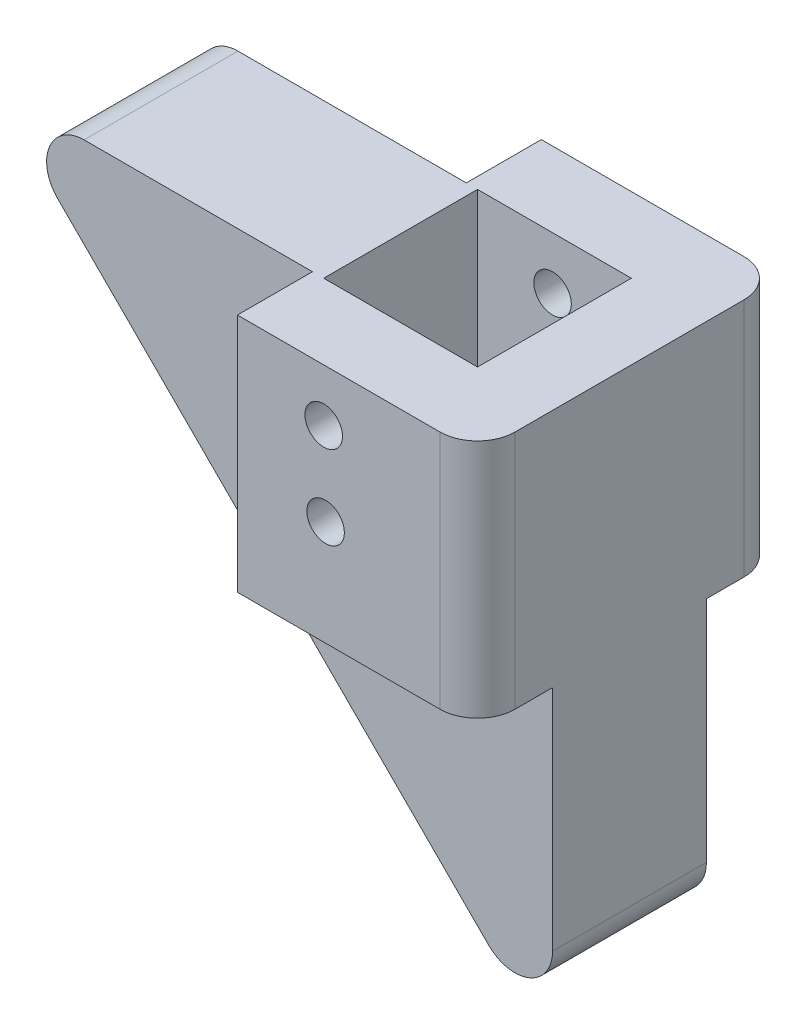
ISO-10303-21;
HEADER;
FILE_DESCRIPTION(('STEP AP214'),'2;1');
FILE_NAME('part.step','',(''),(''),'','','');
FILE_SCHEMA(('AUTOMOTIVE_DESIGN { 1 0 10303 214 1 1 1 1 }'));
ENDSEC;
DATA;
#1=APPLICATION_CONTEXT('core data for automotive mechanical design processes');
#2=APPLICATION_PROTOCOL_DEFINITION('international standard','automotive_design',2000,#1);
#3=PRODUCT_CONTEXT('',#1,'mechanical');
#4=PRODUCT('Part','Part','',(#3));
#5=PRODUCT_RELATED_PRODUCT_CATEGORY('part','',(#4));
#6=PRODUCT_DEFINITION_FORMATION('','',#4);
#7=PRODUCT_DEFINITION_CONTEXT('part definition',#1,'design');
#8=PRODUCT_DEFINITION('design','',#6,#7);
#9=PRODUCT_DEFINITION_SHAPE('','',#8);
#10=(LENGTH_UNIT() NAMED_UNIT(*) SI_UNIT(.MILLI.,.METRE.));
#11=(NAMED_UNIT(*) PLANE_ANGLE_UNIT() SI_UNIT($,.RADIAN.));
#12=(NAMED_UNIT(*) SI_UNIT($,.STERADIAN.) SOLID_ANGLE_UNIT());
#13=UNCERTAINTY_MEASURE_WITH_UNIT(LENGTH_MEASURE(1.E-05),#10,'distance_accuracy_value','');
#14=(GEOMETRIC_REPRESENTATION_CONTEXT(3) GLOBAL_UNCERTAINTY_ASSIGNED_CONTEXT((#13)) GLOBAL_UNIT_ASSIGNED_CONTEXT((#10,
#11,#12)) REPRESENTATION_CONTEXT('',''));
#15=CARTESIAN_POINT('',(0.,0.,0.));
#16=DIRECTION('',(0.,0.,1.));
#17=DIRECTION('',(1.,0.,0.));
#18=AXIS2_PLACEMENT_3D('',#15,#16,#17);
#19=CARTESIAN_POINT('',(0.,0.,0.));
#20=DIRECTION('',(0.,0.,1.));
#21=DIRECTION('',(1.,0.,0.));
#22=AXIS2_PLACEMENT_3D('',#19,#20,#21);
#23=PLANE('',#22);
#24=CARTESIAN_POINT('',(2.37412982933467,-20.8727925216274,0.));
#25=DIRECTION('',(0.,0.,1.));
#26=DIRECTION('',(1.,0.,0.));
#27=AXIS2_PLACEMENT_3D('',#24,#25,#26);
#28=CIRCLE('',#27,2.5);
#29=CARTESIAN_POINT('',(4.87412982933467,-20.8727925216274,0.));
#30=VERTEX_POINT('',#29);
#31=EDGE_CURVE('E222',#30,#30,#28,.T.);
#32=ORIENTED_EDGE('',*,*,#31,.T.);
#33=EDGE_LOOP('',(#32));
#34=FACE_BOUND('',#33,.T.);
#35=CARTESIAN_POINT('',(-12.298157313412,-6.20050537888066,0.));
#36=DIRECTION('',(0.,0.,1.));
#37=DIRECTION('',(1.,0.,0.));
#38=AXIS2_PLACEMENT_3D('',#35,#36,#37);
#39=CIRCLE('',#38,2.5);
#40=CARTESIAN_POINT('',(-9.79815731341203,-6.20050537888066,0.));
#41=VERTEX_POINT('',#40);
#42=EDGE_CURVE('E230',#41,#41,#39,.T.);
#43=ORIENTED_EDGE('',*,*,#42,.T.);
#44=EDGE_LOOP('',(#43));
#45=FACE_BOUND('',#44,.T.);
#46=DIRECTION('',(0.,-1.,0.));
#47=VECTOR('',#46,1.);
#48=CARTESIAN_POINT('',(26.701842686588,0.,0.));
#49=LINE('',#48,#47);
#50=CARTESIAN_POINT('',(26.701842686588,-13.8727925216274,0.));
#51=VERTEX_POINT('',#50);
#52=CARTESIAN_POINT('',(26.701842686588,-44.3017247097626,0.));
#53=VERTEX_POINT('',#52);
#54=EDGE_CURVE('E292',#51,#53,#49,.T.);
#55=ORIENTED_EDGE('',*,*,#54,.T.);
#56=CARTESIAN_POINT('',(21.701842686588,-44.3017247097626,0.));
#57=DIRECTION('',(0.,0.,1.));
#58=DIRECTION('',(1.,0.,0.));
#59=AXIS2_PLACEMENT_3D('',#56,#57,#58);
#60=CIRCLE('',#59,5.);
#61=CARTESIAN_POINT('',(18.1663087806552,-47.8372586156953,0.));
#62=VERTEX_POINT('',#61);
#63=EDGE_CURVE('E378',#53,#62,#60,.F.);
#64=ORIENTED_EDGE('',*,*,#63,.T.);
#65=DIRECTION('',(-0.707106781186544,0.707106781186551,0.));
#66=VECTOR('',#65,1.);
#67=CARTESIAN_POINT('',(-14.8354749175199,-14.8354749175198,0.));
#68=LINE('',#67,#66);
#69=CARTESIAN_POINT('',(-39.2626234074794,9.59167357243993,0.));
#70=VERTEX_POINT('',#69);
#71=EDGE_CURVE('E325',#62,#70,#68,.T.);
#72=ORIENTED_EDGE('',*,*,#71,.T.);
#73=CARTESIAN_POINT('',(-35.7270895015466,13.1272074783726,0.));
#74=DIRECTION('',(0.,0.,1.));
#75=DIRECTION('',(1.,0.,0.));
#76=AXIS2_PLACEMENT_3D('',#73,#74,#75);
#77=CIRCLE('',#76,5.);
#78=CARTESIAN_POINT('',(-35.7270895015466,18.1272074783727,0.));
#79=VERTEX_POINT('',#78);
#80=EDGE_CURVE('E375',#70,#79,#77,.F.);
#81=ORIENTED_EDGE('',*,*,#80,.T.);
#82=DIRECTION('',(1.,0.,0.));
#83=VECTOR('',#82,1.);
#84=CARTESIAN_POINT('',(0.,18.1272074783727,0.));
#85=LINE('',#84,#83);
#86=CARTESIAN_POINT('',(-5.29815731341203,18.1272074783727,0.));
#87=VERTEX_POINT('',#86);
#88=EDGE_CURVE('E322',#79,#87,#85,.T.);
#89=ORIENTED_EDGE('',*,*,#88,.T.);
#90=DIRECTION('',(0.,1.,0.));
#91=VECTOR('',#90,1.);
#92=CARTESIAN_POINT('',(-5.29815731341203,-13.8727925216274,0.));
#93=LINE('',#92,#91);
#94=CARTESIAN_POINT('',(-5.29815731341203,-13.8727925216274,0.));
#95=VERTEX_POINT('',#94);
#96=EDGE_CURVE('E275',#95,#87,#93,.T.);
#97=ORIENTED_EDGE('',*,*,#96,.F.);
#98=DIRECTION('',(-1.,0.,0.));
#99=VECTOR('',#98,1.);
#100=CARTESIAN_POINT('',(26.701842686588,-13.8727925216274,0.));
#101=LINE('',#100,#99);
#102=EDGE_CURVE('E183',#51,#95,#101,.T.);
#103=ORIENTED_EDGE('',*,*,#102,.F.);
#104=EDGE_LOOP('',(#55,#64,#72,#81,#89,#97,#103));
#105=FACE_BOUND('',#104,.T.);
#106=ADVANCED_FACE('F43',(#34,#45,#105),#23,.F.);
#107=CARTESIAN_POINT('',(16.701842686588,0.,20.5));
#108=DIRECTION('',(-1.,0.,0.));
#109=DIRECTION('',(0.,0.,1.));
#110=AXIS2_PLACEMENT_3D('',#107,#108,#109);
#111=PLANE('',#110);
#112=DIRECTION('',(0.,1.,0.));
#113=VECTOR('',#112,1.);
#114=CARTESIAN_POINT('',(16.701842686588,0.,0.));
#115=LINE('',#114,#113);
#116=CARTESIAN_POINT('',(16.701842686588,-6.87279252162735,0.));
#117=VERTEX_POINT('',#116);
#118=CARTESIAN_POINT('',(16.701842686588,18.1272074783727,0.));
#119=VERTEX_POINT('',#118);
#120=EDGE_CURVE('E286',#117,#119,#115,.T.);
#121=ORIENTED_EDGE('',*,*,#120,.F.);
#122=DIRECTION('',(0.,0.,-1.));
#123=VECTOR('',#122,1.);
#124=CARTESIAN_POINT('',(16.701842686588,-6.87279252162735,20.5));
#125=LINE('',#124,#123);
#126=CARTESIAN_POINT('',(16.701842686588,-6.87279252162735,20.5));
#127=VERTEX_POINT('',#126);
#128=EDGE_CURVE('E344',#127,#117,#125,.T.);
#129=ORIENTED_EDGE('',*,*,#128,.F.);
#130=DIRECTION('',(0.,1.,0.));
#131=VECTOR('',#130,1.);
#132=CARTESIAN_POINT('',(16.701842686588,0.,20.5));
#133=LINE('',#132,#131);
#134=CARTESIAN_POINT('',(16.701842686588,18.1272074783727,20.5));
#135=VERTEX_POINT('',#134);
#136=EDGE_CURVE('E287',#127,#135,#133,.T.);
#137=ORIENTED_EDGE('',*,*,#136,.T.);
#138=DIRECTION('',(0.,0.,-1.));
#139=VECTOR('',#138,1.);
#140=CARTESIAN_POINT('',(16.701842686588,18.1272074783727,20.5));
#141=LINE('',#140,#139);
#142=EDGE_CURVE('E310',#135,#119,#141,.T.);
#143=ORIENTED_EDGE('',*,*,#142,.T.);
#144=EDGE_LOOP('',(#121,#129,#137,#143));
#145=FACE_BOUND('',#144,.T.);
#146=ADVANCED_FACE('F445',(#145),#111,.T.);
#147=CARTESIAN_POINT('',(0.,-6.87279252162735,20.5));
#148=DIRECTION('',(0.,1.,0.));
#149=DIRECTION('',(0.,0.,1.));
#150=AXIS2_PLACEMENT_3D('',#147,#148,#149);
#151=PLANE('',#150);
#152=DIRECTION('',(1.,0.,0.));
#153=VECTOR('',#152,1.);
#154=CARTESIAN_POINT('',(0.,-6.87279252162735,0.));
#155=LINE('',#154,#153);
#156=CARTESIAN_POINT('',(-3.79815731341203,-6.87279252162735,0.));
#157=VERTEX_POINT('',#156);
#158=EDGE_CURVE('E314',#157,#117,#155,.T.);
#159=ORIENTED_EDGE('',*,*,#158,.F.);
#160=DIRECTION('',(0.,0.,-1.));
#161=VECTOR('',#160,1.);
#162=CARTESIAN_POINT('',(-3.79815731341203,-6.87279252162735,20.5));
#163=LINE('',#162,#161);
#164=CARTESIAN_POINT('',(-3.79815731341203,-6.87279252162735,20.5));
#165=VERTEX_POINT('',#164);
#166=EDGE_CURVE('E341',#165,#157,#163,.T.);
#167=ORIENTED_EDGE('',*,*,#166,.F.);
#168=DIRECTION('',(1.,0.,0.));
#169=VECTOR('',#168,1.);
#170=CARTESIAN_POINT('',(0.,-6.87279252162735,20.5));
#171=LINE('',#170,#169);
#172=EDGE_CURVE('E291',#165,#127,#171,.T.);
#173=ORIENTED_EDGE('',*,*,#172,.T.);
#174=ORIENTED_EDGE('',*,*,#128,.T.);
#175=EDGE_LOOP('',(#159,#167,#173,#174));
#176=FACE_BOUND('',#175,.T.);
#177=ADVANCED_FACE('F451',(#176),#151,.T.);
#178=CARTESIAN_POINT('',(-3.79815731341203,0.,20.5));
#179=DIRECTION('',(1.,0.,0.));
#180=DIRECTION('',(0.,0.,-1.));
#181=AXIS2_PLACEMENT_3D('',#178,#179,#180);
#182=PLANE('',#181);
#183=DIRECTION('',(0.,-1.,0.));
#184=VECTOR('',#183,1.);
#185=CARTESIAN_POINT('',(-3.79815731341203,0.,0.));
#186=LINE('',#185,#184);
#187=CARTESIAN_POINT('',(-3.79815731341203,18.1272074783727,0.));
#188=VERTEX_POINT('',#187);
#189=EDGE_CURVE('E318',#188,#157,#186,.T.);
#190=ORIENTED_EDGE('',*,*,#189,.F.);
#191=DIRECTION('',(0.,0.,-1.));
#192=VECTOR('',#191,1.);
#193=CARTESIAN_POINT('',(-3.79815731341203,18.1272074783727,20.5));
#194=LINE('',#193,#192);
#195=CARTESIAN_POINT('',(-3.79815731341203,18.1272074783727,20.5));
#196=VERTEX_POINT('',#195);
#197=EDGE_CURVE('E338',#196,#188,#194,.T.);
#198=ORIENTED_EDGE('',*,*,#197,.F.);
#199=DIRECTION('',(0.,-1.,0.));
#200=VECTOR('',#199,1.);
#201=CARTESIAN_POINT('',(-3.79815731341203,0.,20.5));
#202=LINE('',#201,#200);
#203=EDGE_CURVE('E296',#196,#165,#202,.T.);
#204=ORIENTED_EDGE('',*,*,#203,.T.);
#205=ORIENTED_EDGE('',*,*,#166,.T.);
#206=EDGE_LOOP('',(#190,#198,#204,#205));
#207=FACE_BOUND('',#206,.T.);
#208=ADVANCED_FACE('F465',(#207),#182,.T.);
#209=CARTESIAN_POINT('',(-14.8354749175199,-14.8354749175198,20.5));
#210=DIRECTION('',(-0.707106781186551,-0.707106781186544,0.));
#211=DIRECTION('',(0.707106781186544,-0.707106781186551,0.));
#212=AXIS2_PLACEMENT_3D('',#209,#210,#211);
#213=PLANE('',#212);
#214=ORIENTED_EDGE('',*,*,#71,.F.);
#215=DIRECTION('',(0.,0.,-1.));
#216=VECTOR('',#215,1.);
#217=CARTESIAN_POINT('',(18.1663087806552,-47.8372586156953,20.5));
#218=LINE('',#217,#216);
#219=CARTESIAN_POINT('',(18.1663087806552,-47.8372586156953,20.5));
#220=VERTEX_POINT('',#219);
#221=EDGE_CURVE('E385',#62,#220,#218,.F.);
#222=ORIENTED_EDGE('',*,*,#221,.T.);
#223=DIRECTION('',(-0.707106781186544,0.707106781186551,0.));
#224=VECTOR('',#223,1.);
#225=CARTESIAN_POINT('',(-14.8354749175199,-14.8354749175198,20.5));
#226=LINE('',#225,#224);
#227=CARTESIAN_POINT('',(-39.2626234074794,9.59167357243993,20.5));
#228=VERTEX_POINT('',#227);
#229=EDGE_CURVE('E303',#220,#228,#226,.T.);
#230=ORIENTED_EDGE('',*,*,#229,.T.);
#231=DIRECTION('',(0.,0.,-1.));
#232=VECTOR('',#231,1.);
#233=CARTESIAN_POINT('',(-39.2626234074794,9.59167357243993,20.5));
#234=LINE('',#233,#232);
#235=EDGE_CURVE('E381',#228,#70,#234,.T.);
#236=ORIENTED_EDGE('',*,*,#235,.T.);
#237=EDGE_LOOP('',(#214,#222,#230,#236));
#238=FACE_BOUND('',#237,.T.);
#239=ADVANCED_FACE('F404',(#238),#213,.T.);
#240=CARTESIAN_POINT('',(26.701842686588,0.,20.5));
#241=DIRECTION('',(1.,0.,0.));
#242=DIRECTION('',(0.,1.,0.));
#243=AXIS2_PLACEMENT_3D('',#240,#241,#242);
#244=PLANE('',#243);
#245=DIRECTION('',(0.,-1.,0.));
#246=VECTOR('',#245,1.);
#247=CARTESIAN_POINT('',(26.701842686588,0.,20.5));
#248=LINE('',#247,#246);
#249=CARTESIAN_POINT('',(26.701842686588,-13.8727925216274,20.5));
#250=VERTEX_POINT('',#249);
#251=CARTESIAN_POINT('',(26.701842686588,-44.3017247097626,20.5));
#252=VERTEX_POINT('',#251);
#253=EDGE_CURVE('E306',#250,#252,#248,.T.);
#254=ORIENTED_EDGE('',*,*,#253,.T.);
#255=DIRECTION('',(0.,0.,-1.));
#256=VECTOR('',#255,1.);
#257=CARTESIAN_POINT('',(26.701842686588,-44.3017247097626,20.5));
#258=LINE('',#257,#256);
#259=EDGE_CURVE('E371',#252,#53,#258,.T.);
#260=ORIENTED_EDGE('',*,*,#259,.T.);
#261=ORIENTED_EDGE('',*,*,#54,.F.);
#262=DIRECTION('',(0.,0.,1.));
#263=VECTOR('',#262,1.);
#264=CARTESIAN_POINT('',(26.701842686588,-13.8727925216274,-8.));
#265=LINE('',#264,#263);
#266=CARTESIAN_POINT('',(26.701842686588,-13.8727925216274,-5.));
#267=VERTEX_POINT('',#266);
#268=EDGE_CURVE('E187',#267,#51,#265,.T.);
#269=ORIENTED_EDGE('',*,*,#268,.F.);
#270=DIRECTION('',(0.,-1.,0.));
#271=VECTOR('',#270,1.);
#272=CARTESIAN_POINT('',(26.701842686588,18.1272074783727,-5.));
#273=LINE('',#272,#271);
#274=CARTESIAN_POINT('',(26.701842686588,18.1272074783727,-5.));
#275=VERTEX_POINT('',#274);
#276=EDGE_CURVE('E355',#267,#275,#273,.F.);
#277=ORIENTED_EDGE('',*,*,#276,.T.);
#278=DIRECTION('',(0.,0.,-1.));
#279=VECTOR('',#278,1.);
#280=CARTESIAN_POINT('',(26.701842686588,18.1272074783727,20.5));
#281=LINE('',#280,#279);
#282=CARTESIAN_POINT('',(26.701842686588,18.1272074783727,25.5));
#283=VERTEX_POINT('',#282);
#284=EDGE_CURVE('E334',#283,#275,#281,.T.);
#285=ORIENTED_EDGE('',*,*,#284,.F.);
#286=DIRECTION('',(0.,1.,0.));
#287=VECTOR('',#286,1.);
#288=CARTESIAN_POINT('',(26.701842686588,-13.8727925216274,25.5));
#289=LINE('',#288,#287);
#290=CARTESIAN_POINT('',(26.701842686588,-13.8727925216274,25.5));
#291=VERTEX_POINT('',#290);
#292=EDGE_CURVE('E352',#283,#291,#289,.F.);
#293=ORIENTED_EDGE('',*,*,#292,.T.);
#294=DIRECTION('',(0.,0.,-1.));
#295=VECTOR('',#294,1.);
#296=CARTESIAN_POINT('',(26.701842686588,-13.8727925216274,27.5));
#297=LINE('',#296,#295);
#298=EDGE_CURVE('E262',#291,#250,#297,.T.);
#299=ORIENTED_EDGE('',*,*,#298,.T.);
#300=EDGE_LOOP('',(#254,#260,#261,#269,#277,#285,#293,#299));
#301=FACE_BOUND('',#300,.T.);
#302=ADVANCED_FACE('F397',(#301),#244,.T.);
#303=CARTESIAN_POINT('',(0.,18.1272074783727,20.5));
#304=DIRECTION('',(0.,1.,0.));
#305=DIRECTION('',(0.,0.,1.));
#306=AXIS2_PLACEMENT_3D('',#303,#304,#305);
#307=PLANE('',#306);
#308=DIRECTION('',(-1.,0.,0.));
#309=VECTOR('',#308,1.);
#310=CARTESIAN_POINT('',(26.701842686588,18.1272074783727,20.5));
#311=LINE('',#310,#309);
#312=EDGE_CURVE('E250',#135,#196,#311,.T.);
#313=ORIENTED_EDGE('',*,*,#312,.T.);
#314=ORIENTED_EDGE('',*,*,#197,.T.);
#315=DIRECTION('',(1.,0.,0.));
#316=VECTOR('',#315,1.);
#317=CARTESIAN_POINT('',(26.701842686588,18.1272074783726,0.));
#318=LINE('',#317,#316);
#319=EDGE_CURVE('E278',#188,#119,#318,.T.);
#320=ORIENTED_EDGE('',*,*,#319,.T.);
#321=ORIENTED_EDGE('',*,*,#142,.F.);
#322=EDGE_LOOP('',(#313,#314,#320,#321));
#323=FACE_BOUND('',#322,.T.);
#324=ORIENTED_EDGE('',*,*,#88,.F.);
#325=DIRECTION('',(0.,0.,-1.));
#326=VECTOR('',#325,1.);
#327=CARTESIAN_POINT('',(-35.7270895015466,18.1272074783727,20.5));
#328=LINE('',#327,#326);
#329=CARTESIAN_POINT('',(-35.7270895015466,18.1272074783727,20.5));
#330=VERTEX_POINT('',#329);
#331=EDGE_CURVE('E11',#79,#330,#328,.F.);
#332=ORIENTED_EDGE('',*,*,#331,.T.);
#333=DIRECTION('',(1.,0.,0.));
#334=VECTOR('',#333,1.);
#335=CARTESIAN_POINT('',(0.,18.1272074783727,20.5));
#336=LINE('',#335,#334);
#337=CARTESIAN_POINT('',(-5.29815731341203,18.1272074783727,20.5));
#338=VERTEX_POINT('',#337);
#339=EDGE_CURVE('E300',#330,#338,#336,.T.);
#340=ORIENTED_EDGE('',*,*,#339,.T.);
#341=DIRECTION('',(0.,0.,-1.));
#342=VECTOR('',#341,1.);
#343=CARTESIAN_POINT('',(-5.29815731341203,18.1272074783726,27.5));
#344=LINE('',#343,#342);
#345=CARTESIAN_POINT('',(-5.29815731341202,18.1272074783727,30.5));
#346=VERTEX_POINT('',#345);
#347=EDGE_CURVE('E269',#346,#338,#344,.T.);
#348=ORIENTED_EDGE('',*,*,#347,.F.);
#349=DIRECTION('',(-1.,0.,0.));
#350=VECTOR('',#349,1.);
#351=CARTESIAN_POINT('',(-5.29815731341202,18.1272074783727,30.5));
#352=LINE('',#351,#350);
#353=CARTESIAN_POINT('',(21.701842686588,18.1272074783727,30.5));
#354=VERTEX_POINT('',#353);
#355=EDGE_CURVE('E215',#354,#346,#352,.T.);
#356=ORIENTED_EDGE('',*,*,#355,.F.);
#357=CARTESIAN_POINT('',(21.701842686588,18.1272074783727,25.5));
#358=DIRECTION('',(0.,1.,0.));
#359=DIRECTION('',(0.,0.,1.));
#360=AXIS2_PLACEMENT_3D('',#357,#358,#359);
#361=CIRCLE('',#360,5.);
#362=EDGE_CURVE('E358',#354,#283,#361,.T.);
#363=ORIENTED_EDGE('',*,*,#362,.T.);
#364=ORIENTED_EDGE('',*,*,#284,.T.);
#365=CARTESIAN_POINT('',(21.701842686588,18.1272074783727,-5.));
#366=DIRECTION('',(0.,1.,0.));
#367=DIRECTION('',(0.,0.,1.));
#368=AXIS2_PLACEMENT_3D('',#365,#366,#367);
#369=CIRCLE('',#368,5.);
#370=CARTESIAN_POINT('',(21.701842686588,18.1272074783727,-10.));
#371=VERTEX_POINT('',#370);
#372=EDGE_CURVE('E361',#275,#371,#369,.T.);
#373=ORIENTED_EDGE('',*,*,#372,.T.);
#374=DIRECTION('',(1.,0.,0.));
#375=VECTOR('',#374,1.);
#376=CARTESIAN_POINT('',(26.701842686588,18.1272074783727,-10.));
#377=LINE('',#376,#375);
#378=CARTESIAN_POINT('',(-5.29815731341203,18.1272074783727,-10.));
#379=VERTEX_POINT('',#378);
#380=EDGE_CURVE('E193',#379,#371,#377,.T.);
#381=ORIENTED_EDGE('',*,*,#380,.F.);
#382=DIRECTION('',(0.,0.,1.));
#383=VECTOR('',#382,1.);
#384=CARTESIAN_POINT('',(-5.29815731341203,18.1272074783726,-8.));
#385=LINE('',#384,#383);
#386=EDGE_CURVE('E188',#379,#87,#385,.T.);
#387=ORIENTED_EDGE('',*,*,#386,.T.);
#388=EDGE_LOOP('',(#324,#332,#340,#348,#356,#363,#364,#373,#381,#387));
#389=FACE_BOUND('',#388,.T.);
#390=ADVANCED_FACE('F407',(#323,#389),#307,.T.);
#391=CARTESIAN_POINT('',(0.,0.,20.5));
#392=DIRECTION('',(0.,0.,1.));
#393=DIRECTION('',(1.,0.,0.));
#394=AXIS2_PLACEMENT_3D('',#391,#392,#393);
#395=PLANE('',#394);
#396=CARTESIAN_POINT('',(2.37412982933467,-20.8727925216274,20.5));
#397=DIRECTION('',(0.,0.,1.));
#398=DIRECTION('',(1.,0.,0.));
#399=AXIS2_PLACEMENT_3D('',#396,#397,#398);
#400=CIRCLE('',#399,2.5);
#401=CARTESIAN_POINT('',(4.87412982933467,-20.8727925216274,20.5));
#402=VERTEX_POINT('',#401);
#403=EDGE_CURVE('E218',#402,#402,#400,.T.);
#404=ORIENTED_EDGE('',*,*,#403,.F.);
#405=EDGE_LOOP('',(#404));
#406=FACE_BOUND('',#405,.T.);
#407=CARTESIAN_POINT('',(-12.298157313412,-6.20050537888066,20.5));
#408=DIRECTION('',(0.,0.,1.));
#409=DIRECTION('',(1.,0.,0.));
#410=AXIS2_PLACEMENT_3D('',#407,#408,#409);
#411=CIRCLE('',#410,2.5);
#412=CARTESIAN_POINT('',(-9.79815731341203,-6.20050537888066,20.5));
#413=VERTEX_POINT('',#412);
#414=EDGE_CURVE('E226',#413,#413,#411,.T.);
#415=ORIENTED_EDGE('',*,*,#414,.F.);
#416=EDGE_LOOP('',(#415));
#417=FACE_BOUND('',#416,.T.);
#418=ORIENTED_EDGE('',*,*,#229,.F.);
#419=CARTESIAN_POINT('',(21.701842686588,-44.3017247097626,20.5));
#420=DIRECTION('',(0.,0.,1.));
#421=DIRECTION('',(1.,0.,0.));
#422=AXIS2_PLACEMENT_3D('',#419,#420,#421);
#423=CIRCLE('',#422,5.);
#424=EDGE_CURVE('E52',#220,#252,#423,.T.);
#425=ORIENTED_EDGE('',*,*,#424,.T.);
#426=ORIENTED_EDGE('',*,*,#253,.F.);
#427=DIRECTION('',(1.,0.,0.));
#428=VECTOR('',#427,1.);
#429=CARTESIAN_POINT('',(26.701842686588,-13.8727925216274,20.5));
#430=LINE('',#429,#428);
#431=CARTESIAN_POINT('',(-5.29815731341202,-13.8727925216274,20.5));
#432=VERTEX_POINT('',#431);
#433=EDGE_CURVE('E258',#432,#250,#430,.T.);
#434=ORIENTED_EDGE('',*,*,#433,.F.);
#435=DIRECTION('',(0.,-1.,0.));
#436=VECTOR('',#435,1.);
#437=CARTESIAN_POINT('',(-5.29815731341203,18.1272074783726,20.5));
#438=LINE('',#437,#436);
#439=EDGE_CURVE('E254',#338,#432,#438,.T.);
#440=ORIENTED_EDGE('',*,*,#439,.F.);
#441=ORIENTED_EDGE('',*,*,#339,.F.);
#442=CARTESIAN_POINT('',(-35.7270895015466,13.1272074783726,20.5));
#443=DIRECTION('',(0.,0.,1.));
#444=DIRECTION('',(1.,0.,0.));
#445=AXIS2_PLACEMENT_3D('',#442,#443,#444);
#446=CIRCLE('',#445,5.);
#447=EDGE_CURVE('E64',#330,#228,#446,.T.);
#448=ORIENTED_EDGE('',*,*,#447,.T.);
#449=EDGE_LOOP('',(#418,#425,#426,#434,#440,#441,#448));
#450=FACE_BOUND('',#449,.T.);
#451=ADVANCED_FACE('F392',(#406,#417,#450),#395,.T.);
#452=CARTESIAN_POINT('',(26.701842686588,-13.8727925216274,-8.));
#453=DIRECTION('',(0.,1.,0.));
#454=DIRECTION('',(0.,0.,1.));
#455=AXIS2_PLACEMENT_3D('',#452,#453,#454);
#456=PLANE('',#455);
#457=DIRECTION('',(-1.,0.,0.));
#458=VECTOR('',#457,1.);
#459=CARTESIAN_POINT('',(26.701842686588,-13.8727925216274,-10.));
#460=LINE('',#459,#458);
#461=CARTESIAN_POINT('',(21.701842686588,-13.8727925216274,-10.));
#462=VERTEX_POINT('',#461);
#463=CARTESIAN_POINT('',(-5.29815731341202,-13.8727925216274,-10.));
#464=VERTEX_POINT('',#463);
#465=EDGE_CURVE('E164',#462,#464,#460,.T.);
#466=ORIENTED_EDGE('',*,*,#465,.F.);
#467=CARTESIAN_POINT('',(21.701842686588,-13.8727925216274,-5.));
#468=DIRECTION('',(0.,1.,0.));
#469=DIRECTION('',(0.,0.,1.));
#470=AXIS2_PLACEMENT_3D('',#467,#468,#469);
#471=CIRCLE('',#470,5.);
#472=EDGE_CURVE('E349',#462,#267,#471,.F.);
#473=ORIENTED_EDGE('',*,*,#472,.T.);
#474=ORIENTED_EDGE('',*,*,#268,.T.);
#475=ORIENTED_EDGE('',*,*,#102,.T.);
#476=DIRECTION('',(0.,0.,1.));
#477=VECTOR('',#476,1.);
#478=CARTESIAN_POINT('',(-5.29815731341203,-13.8727925216274,-8.));
#479=LINE('',#478,#477);
#480=EDGE_CURVE('E180',#464,#95,#479,.T.);
#481=ORIENTED_EDGE('',*,*,#480,.F.);
#482=EDGE_LOOP('',(#466,#473,#474,#475,#481));
#483=FACE_BOUND('',#482,.T.);
#484=ADVANCED_FACE('F181',(#483),#456,.F.);
#485=CARTESIAN_POINT('',(-5.29815731341203,-13.8727925216274,-8.));
#486=DIRECTION('',(1.,0.,0.));
#487=DIRECTION('',(0.,0.,-1.));
#488=AXIS2_PLACEMENT_3D('',#485,#486,#487);
#489=PLANE('',#488);
#490=ORIENTED_EDGE('',*,*,#96,.T.);
#491=ORIENTED_EDGE('',*,*,#386,.F.);
#492=DIRECTION('',(0.,1.,0.));
#493=VECTOR('',#492,1.);
#494=CARTESIAN_POINT('',(-5.29815731341202,-13.8727925216274,-10.));
#495=LINE('',#494,#493);
#496=EDGE_CURVE('E170',#464,#379,#495,.T.);
#497=ORIENTED_EDGE('',*,*,#496,.F.);
#498=ORIENTED_EDGE('',*,*,#480,.T.);
#499=EDGE_LOOP('',(#490,#491,#497,#498));
#500=FACE_BOUND('',#499,.T.);
#501=ADVANCED_FACE('F190',(#500),#489,.F.);
#502=CARTESIAN_POINT('',(0.,0.,0.));
#503=DIRECTION('',(0.,0.,1.));
#504=DIRECTION('',(1.,0.,0.));
#505=AXIS2_PLACEMENT_3D('',#502,#503,#504);
#506=PLANE('',#505);
#507=CARTESIAN_POINT('',(6.20184268658797,11.1272074783727,0.));
#508=DIRECTION('',(0.,0.,1.));
#509=DIRECTION('',(1.,0.,0.));
#510=AXIS2_PLACEMENT_3D('',#507,#508,#509);
#511=CIRCLE('',#510,2.5);
#512=CARTESIAN_POINT('',(8.70184268658797,11.1272074783727,0.));
#513=VERTEX_POINT('',#512);
#514=EDGE_CURVE('E238',#513,#513,#511,.T.);
#515=ORIENTED_EDGE('',*,*,#514,.F.);
#516=EDGE_LOOP('',(#515));
#517=FACE_BOUND('',#516,.T.);
#518=CARTESIAN_POINT('',(6.45184268658797,0.127207478372648,0.));
#519=DIRECTION('',(0.,0.,1.));
#520=DIRECTION('',(1.,0.,0.));
#521=AXIS2_PLACEMENT_3D('',#518,#519,#520);
#522=CIRCLE('',#521,2.5);
#523=CARTESIAN_POINT('',(8.95184268658797,0.127207478372648,0.));
#524=VERTEX_POINT('',#523);
#525=EDGE_CURVE('E246',#524,#524,#522,.T.);
#526=ORIENTED_EDGE('',*,*,#525,.F.);
#527=EDGE_LOOP('',(#526));
#528=FACE_BOUND('',#527,.T.);
#529=ORIENTED_EDGE('',*,*,#158,.T.);
#530=ORIENTED_EDGE('',*,*,#120,.T.);
#531=ORIENTED_EDGE('',*,*,#319,.F.);
#532=ORIENTED_EDGE('',*,*,#189,.T.);
#533=EDGE_LOOP('',(#529,#530,#531,#532));
#534=FACE_BOUND('',#533,.T.);
#535=ADVANCED_FACE('F440',(#517,#528,#534),#506,.T.);
#536=CARTESIAN_POINT('',(0.,0.,20.5));
#537=DIRECTION('',(0.,0.,-1.));
#538=DIRECTION('',(-1.,0.,0.));
#539=AXIS2_PLACEMENT_3D('',#536,#537,#538);
#540=PLANE('',#539);
#541=CARTESIAN_POINT('',(6.20184268658797,11.1272074783727,20.5));
#542=DIRECTION('',(0.,0.,-1.));
#543=DIRECTION('',(-1.,0.,0.));
#544=AXIS2_PLACEMENT_3D('',#541,#542,#543);
#545=CIRCLE('',#544,2.5);
#546=CARTESIAN_POINT('',(3.70184268658797,11.1272074783727,20.5));
#547=VERTEX_POINT('',#546);
#548=EDGE_CURVE('E234',#547,#547,#545,.T.);
#549=ORIENTED_EDGE('',*,*,#548,.F.);
#550=EDGE_LOOP('',(#549));
#551=FACE_BOUND('',#550,.T.);
#552=CARTESIAN_POINT('',(6.45184268658797,0.127207478372648,20.5));
#553=DIRECTION('',(0.,0.,-1.));
#554=DIRECTION('',(-1.,0.,0.));
#555=AXIS2_PLACEMENT_3D('',#552,#553,#554);
#556=CIRCLE('',#555,2.5);
#557=CARTESIAN_POINT('',(3.95184268658797,0.127207478372648,20.5));
#558=VERTEX_POINT('',#557);
#559=EDGE_CURVE('E242',#558,#558,#556,.T.);
#560=ORIENTED_EDGE('',*,*,#559,.F.);
#561=EDGE_LOOP('',(#560));
#562=FACE_BOUND('',#561,.T.);
#563=ORIENTED_EDGE('',*,*,#136,.F.);
#564=ORIENTED_EDGE('',*,*,#172,.F.);
#565=ORIENTED_EDGE('',*,*,#203,.F.);
#566=ORIENTED_EDGE('',*,*,#312,.F.);
#567=EDGE_LOOP('',(#563,#564,#565,#566));
#568=FACE_BOUND('',#567,.T.);
#569=ADVANCED_FACE('F432',(#551,#562,#568),#540,.T.);
#570=CARTESIAN_POINT('',(-5.29815731341203,18.1272074783726,27.5));
#571=DIRECTION('',(1.,0.,0.));
#572=DIRECTION('',(0.,1.,0.));
#573=AXIS2_PLACEMENT_3D('',#570,#571,#572);
#574=PLANE('',#573);
#575=ORIENTED_EDGE('',*,*,#439,.T.);
#576=DIRECTION('',(0.,0.,-1.));
#577=VECTOR('',#576,1.);
#578=CARTESIAN_POINT('',(-5.29815731341202,-13.8727925216274,27.5));
#579=LINE('',#578,#577);
#580=CARTESIAN_POINT('',(-5.29815731341202,-13.8727925216274,30.5));
#581=VERTEX_POINT('',#580);
#582=EDGE_CURVE('E265',#581,#432,#579,.T.);
#583=ORIENTED_EDGE('',*,*,#582,.F.);
#584=DIRECTION('',(0.,-1.,0.));
#585=VECTOR('',#584,1.);
#586=CARTESIAN_POINT('',(-5.29815731341202,-13.8727925216274,30.5));
#587=LINE('',#586,#585);
#588=EDGE_CURVE('E207',#346,#581,#587,.T.);
#589=ORIENTED_EDGE('',*,*,#588,.F.);
#590=ORIENTED_EDGE('',*,*,#347,.T.);
#591=EDGE_LOOP('',(#575,#583,#589,#590));
#592=FACE_BOUND('',#591,.T.);
#593=ADVANCED_FACE('F430',(#592),#574,.F.);
#594=CARTESIAN_POINT('',(26.701842686588,-13.8727925216274,27.5));
#595=DIRECTION('',(0.,1.,0.));
#596=DIRECTION('',(-1.,0.,0.));
#597=AXIS2_PLACEMENT_3D('',#594,#595,#596);
#598=PLANE('',#597);
#599=ORIENTED_EDGE('',*,*,#298,.F.);
#600=CARTESIAN_POINT('',(21.701842686588,-13.8727925216274,25.5));
#601=DIRECTION('',(0.,1.,0.));
#602=DIRECTION('',(-1.,0.,0.));
#603=AXIS2_PLACEMENT_3D('',#600,#601,#602);
#604=CIRCLE('',#603,5.);
#605=CARTESIAN_POINT('',(21.701842686588,-13.8727925216274,30.5));
#606=VERTEX_POINT('',#605);
#607=EDGE_CURVE('E368',#291,#606,#604,.F.);
#608=ORIENTED_EDGE('',*,*,#607,.T.);
#609=DIRECTION('',(1.,0.,0.));
#610=VECTOR('',#609,1.);
#611=CARTESIAN_POINT('',(-5.29815731341202,-13.8727925216274,30.5));
#612=LINE('',#611,#610);
#613=EDGE_CURVE('E211',#581,#606,#612,.T.);
#614=ORIENTED_EDGE('',*,*,#613,.F.);
#615=ORIENTED_EDGE('',*,*,#582,.T.);
#616=ORIENTED_EDGE('',*,*,#433,.T.);
#617=EDGE_LOOP('',(#599,#608,#614,#615,#616));
#618=FACE_BOUND('',#617,.T.);
#619=ADVANCED_FACE('F427',(#618),#598,.F.);
#620=CARTESIAN_POINT('',(6.45184268658797,0.127207478372648,32.));
#621=DIRECTION('',(0.,0.,-1.));
#622=DIRECTION('',(-1.,0.,0.));
#623=AXIS2_PLACEMENT_3D('',#620,#621,#622);
#624=CYLINDRICAL_SURFACE('',#623,2.5);
#625=ORIENTED_EDGE('',*,*,#559,.T.);
#626=EDGE_LOOP('',(#625));
#627=FACE_BOUND('',#626,.T.);
#628=CARTESIAN_POINT('',(6.45184268658797,0.127207478372648,30.5));
#629=DIRECTION('',(0.,0.,1.));
#630=DIRECTION('',(1.,0.,0.));
#631=AXIS2_PLACEMENT_3D('',#628,#629,#630);
#632=CIRCLE('',#631,2.5);
#633=CARTESIAN_POINT('',(8.95184268658797,0.127207478372648,30.5));
#634=VERTEX_POINT('',#633);
#635=EDGE_CURVE('E196',#634,#634,#632,.T.);
#636=ORIENTED_EDGE('',*,*,#635,.T.);
#637=EDGE_LOOP('',(#636));
#638=FACE_BOUND('',#637,.T.);
#639=ADVANCED_FACE('F438',(#627,#638),#624,.F.);
#640=ORIENTED_EDGE('',*,*,#525,.T.);
#641=EDGE_LOOP('',(#640));
#642=FACE_BOUND('',#641,.T.);
#643=CARTESIAN_POINT('',(6.45184268658797,0.127207478372648,-10.));
#644=DIRECTION('',(0.,0.,-1.));
#645=DIRECTION('',(-1.,0.,0.));
#646=AXIS2_PLACEMENT_3D('',#643,#644,#645);
#647=CIRCLE('',#646,2.5);
#648=CARTESIAN_POINT('',(3.95184268658797,0.127207478372648,-10.));
#649=VERTEX_POINT('',#648);
#650=EDGE_CURVE('E716',#649,#649,#647,.T.);
#651=ORIENTED_EDGE('',*,*,#650,.T.);
#652=EDGE_LOOP('',(#651));
#653=FACE_BOUND('',#652,.T.);
#654=ADVANCED_FACE('F593',(#642,#653),#624,.F.);
#655=CARTESIAN_POINT('',(6.20184268658797,11.1272074783727,32.));
#656=DIRECTION('',(0.,0.,-1.));
#657=DIRECTION('',(-1.,0.,0.));
#658=AXIS2_PLACEMENT_3D('',#655,#656,#657);
#659=CYLINDRICAL_SURFACE('',#658,2.5);
#660=ORIENTED_EDGE('',*,*,#548,.T.);
#661=EDGE_LOOP('',(#660));
#662=FACE_BOUND('',#661,.T.);
#663=CARTESIAN_POINT('',(6.20184268658797,11.1272074783727,30.5));
#664=DIRECTION('',(0.,0.,1.));
#665=DIRECTION('',(1.,0.,0.));
#666=AXIS2_PLACEMENT_3D('',#663,#664,#665);
#667=CIRCLE('',#666,2.5);
#668=CARTESIAN_POINT('',(8.70184268658797,11.1272074783727,30.5));
#669=VERTEX_POINT('',#668);
#670=EDGE_CURVE('E203',#669,#669,#667,.T.);
#671=ORIENTED_EDGE('',*,*,#670,.T.);
#672=EDGE_LOOP('',(#671));
#673=FACE_BOUND('',#672,.T.);
#674=ADVANCED_FACE('F583',(#662,#673),#659,.F.);
#675=ORIENTED_EDGE('',*,*,#514,.T.);
#676=EDGE_LOOP('',(#675));
#677=FACE_BOUND('',#676,.T.);
#678=CARTESIAN_POINT('',(6.20184268658797,11.1272074783727,-10.));
#679=DIRECTION('',(0.,0.,-1.));
#680=DIRECTION('',(-1.,0.,0.));
#681=AXIS2_PLACEMENT_3D('',#678,#679,#680);
#682=CIRCLE('',#681,2.5);
#683=CARTESIAN_POINT('',(3.70184268658797,11.1272074783727,-10.));
#684=VERTEX_POINT('',#683);
#685=EDGE_CURVE('E176',#684,#684,#682,.T.);
#686=ORIENTED_EDGE('',*,*,#685,.T.);
#687=EDGE_LOOP('',(#686));
#688=FACE_BOUND('',#687,.T.);
#689=ADVANCED_FACE('F578',(#677,#688),#659,.F.);
#690=CARTESIAN_POINT('',(-12.298157313412,-6.20050537888066,-19.5));
#691=DIRECTION('',(0.,0.,1.));
#692=DIRECTION('',(1.,0.,0.));
#693=AXIS2_PLACEMENT_3D('',#690,#691,#692);
#694=CYLINDRICAL_SURFACE('',#693,2.5);
#695=ORIENTED_EDGE('',*,*,#414,.T.);
#696=EDGE_LOOP('',(#695));
#697=FACE_BOUND('',#696,.T.);
#698=ORIENTED_EDGE('',*,*,#42,.F.);
#699=EDGE_LOOP('',(#698));
#700=FACE_BOUND('',#699,.T.);
#701=ADVANCED_FACE('F582',(#697,#700),#694,.F.);
#702=CARTESIAN_POINT('',(2.37412982933467,-20.8727925216274,-19.5));
#703=DIRECTION('',(0.,0.,1.));
#704=DIRECTION('',(1.,0.,0.));
#705=AXIS2_PLACEMENT_3D('',#702,#703,#704);
#706=CYLINDRICAL_SURFACE('',#705,2.5);
#707=ORIENTED_EDGE('',*,*,#403,.T.);
#708=EDGE_LOOP('',(#707));
#709=FACE_BOUND('',#708,.T.);
#710=ORIENTED_EDGE('',*,*,#31,.F.);
#711=EDGE_LOOP('',(#710));
#712=FACE_BOUND('',#711,.T.);
#713=ADVANCED_FACE('F553',(#709,#712),#706,.F.);
#714=CARTESIAN_POINT('',(0.,0.,30.5));
#715=DIRECTION('',(0.,0.,-1.));
#716=DIRECTION('',(-1.,0.,0.));
#717=AXIS2_PLACEMENT_3D('',#714,#715,#716);
#718=PLANE('',#717);
#719=ORIENTED_EDGE('',*,*,#613,.T.);
#720=DIRECTION('',(0.,1.,0.));
#721=VECTOR('',#720,1.);
#722=CARTESIAN_POINT('',(21.701842686588,18.1272074783727,30.5));
#723=LINE('',#722,#721);
#724=EDGE_CURVE('E364',#606,#354,#723,.T.);
#725=ORIENTED_EDGE('',*,*,#724,.T.);
#726=ORIENTED_EDGE('',*,*,#355,.T.);
#727=ORIENTED_EDGE('',*,*,#588,.T.);
#728=EDGE_LOOP('',(#719,#725,#726,#727));
#729=FACE_BOUND('',#728,.T.);
#730=ORIENTED_EDGE('',*,*,#670,.F.);
#731=EDGE_LOOP('',(#730));
#732=FACE_BOUND('',#731,.T.);
#733=ORIENTED_EDGE('',*,*,#635,.F.);
#734=EDGE_LOOP('',(#733));
#735=FACE_BOUND('',#734,.T.);
#736=ADVANCED_FACE('F422',(#729,#732,#735),#718,.F.);
#737=CARTESIAN_POINT('',(0.,0.,-10.));
#738=DIRECTION('',(0.,0.,1.));
#739=DIRECTION('',(1.,0.,0.));
#740=AXIS2_PLACEMENT_3D('',#737,#738,#739);
#741=PLANE('',#740);
#742=ORIENTED_EDGE('',*,*,#380,.T.);
#743=DIRECTION('',(0.,-1.,0.));
#744=VECTOR('',#743,1.);
#745=CARTESIAN_POINT('',(21.701842686588,-13.8727925216274,-10.));
#746=LINE('',#745,#744);
#747=EDGE_CURVE('E173',#371,#462,#746,.T.);
#748=ORIENTED_EDGE('',*,*,#747,.T.);
#749=ORIENTED_EDGE('',*,*,#465,.T.);
#750=ORIENTED_EDGE('',*,*,#496,.T.);
#751=EDGE_LOOP('',(#742,#748,#749,#750));
#752=FACE_BOUND('',#751,.T.);
#753=ORIENTED_EDGE('',*,*,#685,.F.);
#754=EDGE_LOOP('',(#753));
#755=FACE_BOUND('',#754,.T.);
#756=ORIENTED_EDGE('',*,*,#650,.F.);
#757=EDGE_LOOP('',(#756));
#758=FACE_BOUND('',#757,.T.);
#759=ADVANCED_FACE('F167',(#752,#755,#758),#741,.F.);
#760=CARTESIAN_POINT('',(21.701842686588,0.,-5.));
#761=DIRECTION('',(0.,1.,0.));
#762=DIRECTION('',(-1.,0.,0.));
#763=AXIS2_PLACEMENT_3D('',#760,#761,#762);
#764=CYLINDRICAL_SURFACE('',#763,5.);
#765=ORIENTED_EDGE('',*,*,#372,.F.);
#766=ORIENTED_EDGE('',*,*,#276,.F.);
#767=ORIENTED_EDGE('',*,*,#472,.F.);
#768=ORIENTED_EDGE('',*,*,#747,.F.);
#769=EDGE_LOOP('',(#765,#766,#767,#768));
#770=FACE_BOUND('',#769,.T.);
#771=ADVANCED_FACE('F410',(#770),#764,.T.);
#772=CARTESIAN_POINT('',(21.701842686588,0.,25.5));
#773=DIRECTION('',(0.,-1.,0.));
#774=DIRECTION('',(1.,0.,0.));
#775=AXIS2_PLACEMENT_3D('',#772,#773,#774);
#776=CYLINDRICAL_SURFACE('',#775,5.);
#777=ORIENTED_EDGE('',*,*,#607,.F.);
#778=ORIENTED_EDGE('',*,*,#292,.F.);
#779=ORIENTED_EDGE('',*,*,#362,.F.);
#780=ORIENTED_EDGE('',*,*,#724,.F.);
#781=EDGE_LOOP('',(#777,#778,#779,#780));
#782=FACE_BOUND('',#781,.T.);
#783=ADVANCED_FACE('F420',(#782),#776,.T.);
#784=CARTESIAN_POINT('',(21.701842686588,-44.3017247097626,20.5));
#785=DIRECTION('',(0.,0.,-1.));
#786=DIRECTION('',(-1.,0.,0.));
#787=AXIS2_PLACEMENT_3D('',#784,#785,#786);
#788=CYLINDRICAL_SURFACE('',#787,5.);
#789=ORIENTED_EDGE('',*,*,#424,.F.);
#790=ORIENTED_EDGE('',*,*,#221,.F.);
#791=ORIENTED_EDGE('',*,*,#63,.F.);
#792=ORIENTED_EDGE('',*,*,#259,.F.);
#793=EDGE_LOOP('',(#789,#790,#791,#792));
#794=FACE_BOUND('',#793,.T.);
#795=ADVANCED_FACE('F400',(#794),#788,.T.);
#796=CARTESIAN_POINT('',(-35.7270895015466,13.1272074783726,20.5));
#797=DIRECTION('',(0.,0.,-1.));
#798=DIRECTION('',(-1.,0.,0.));
#799=AXIS2_PLACEMENT_3D('',#796,#797,#798);
#800=CYLINDRICAL_SURFACE('',#799,5.);
#801=ORIENTED_EDGE('',*,*,#447,.F.);
#802=ORIENTED_EDGE('',*,*,#331,.F.);
#803=ORIENTED_EDGE('',*,*,#80,.F.);
#804=ORIENTED_EDGE('',*,*,#235,.F.);
#805=EDGE_LOOP('',(#801,#802,#803,#804));
#806=FACE_BOUND('',#805,.T.);
#807=ADVANCED_FACE('F45',(#806),#800,.T.);
#808=CLOSED_SHELL('',(#106,#146,#177,#208,#239,#302,#390,#451,#484,#501,#535,#569,#593,#619,
#639,#654,#674,#689,#701,#713,#736,#759,#771,#783,#795,#807));
#809=MANIFOLD_SOLID_BREP('B2',#808);
#810=ADVANCED_BREP_SHAPE_REPRESENTATION('',(#18,#809),#14);
#811=SHAPE_DEFINITION_REPRESENTATION(#9,#810);
ENDSEC;
END-ISO-10303-21;
